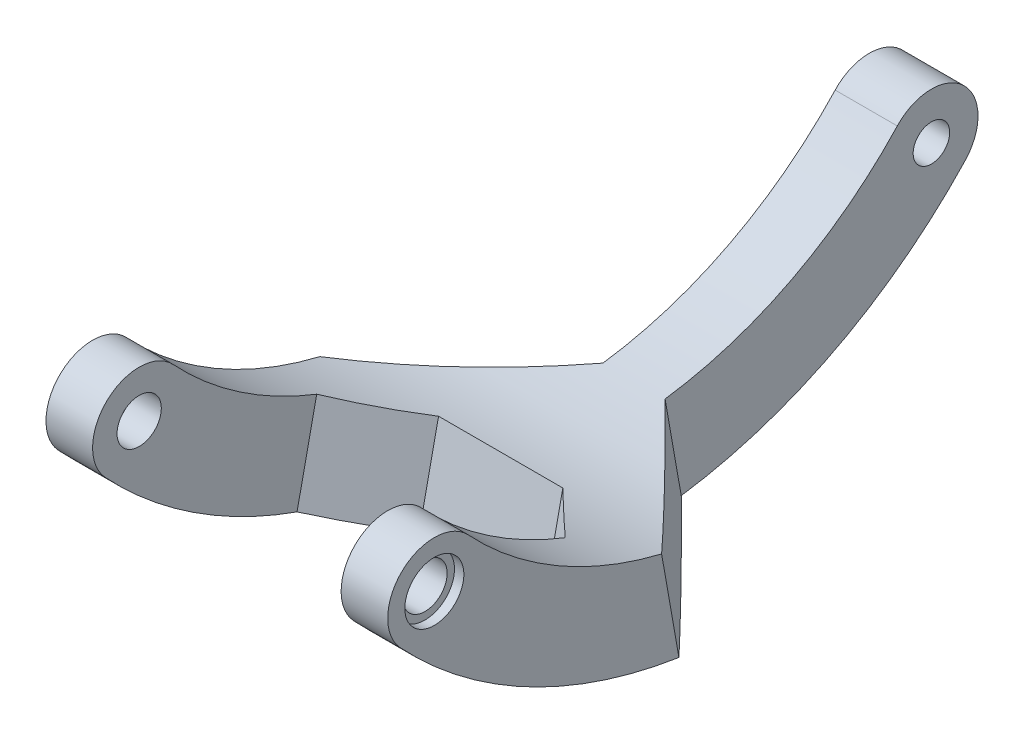
ISO-10303-21;
HEADER;
FILE_DESCRIPTION(('STEP AP214'),'2;1');
FILE_NAME('part.step','',(''),(''),'','','');
FILE_SCHEMA(('AUTOMOTIVE_DESIGN { 1 0 10303 214 1 1 1 1 }'));
ENDSEC;
DATA;
#1=APPLICATION_CONTEXT('core data for automotive mechanical design processes');
#2=APPLICATION_PROTOCOL_DEFINITION('international standard','automotive_design',2000,#1);
#3=PRODUCT_CONTEXT('',#1,'mechanical');
#4=PRODUCT('Part','Part','',(#3));
#5=PRODUCT_RELATED_PRODUCT_CATEGORY('part','',(#4));
#6=PRODUCT_DEFINITION_FORMATION('','',#4);
#7=PRODUCT_DEFINITION_CONTEXT('part definition',#1,'design');
#8=PRODUCT_DEFINITION('design','',#6,#7);
#9=PRODUCT_DEFINITION_SHAPE('','',#8);
#10=(LENGTH_UNIT() NAMED_UNIT(*) SI_UNIT(.MILLI.,.METRE.));
#11=(NAMED_UNIT(*) PLANE_ANGLE_UNIT() SI_UNIT($,.RADIAN.));
#12=(NAMED_UNIT(*) SI_UNIT($,.STERADIAN.) SOLID_ANGLE_UNIT());
#13=UNCERTAINTY_MEASURE_WITH_UNIT(LENGTH_MEASURE(1.E-05),#10,'distance_accuracy_value','');
#14=(GEOMETRIC_REPRESENTATION_CONTEXT(3) GLOBAL_UNCERTAINTY_ASSIGNED_CONTEXT((#13)) GLOBAL_UNIT_ASSIGNED_CONTEXT((#10,
#11,#12)) REPRESENTATION_CONTEXT('',''));
#15=CARTESIAN_POINT('',(0.,0.,0.));
#16=DIRECTION('',(0.,0.,1.));
#17=DIRECTION('',(1.,0.,0.));
#18=AXIS2_PLACEMENT_3D('',#15,#16,#17);
#19=CARTESIAN_POINT('',(11.,0.,20.5));
#20=DIRECTION('',(-1.,0.,0.));
#21=DIRECTION('',(0.,0.,1.));
#22=AXIS2_PLACEMENT_3D('',#19,#20,#21);
#23=CYLINDRICAL_SURFACE('',#22,1.425);
#24=CARTESIAN_POINT('',(-8.,0.,20.5));
#25=DIRECTION('',(1.,0.,0.));
#26=DIRECTION('',(0.,0.,-1.));
#27=AXIS2_PLACEMENT_3D('',#24,#25,#26);
#28=CIRCLE('',#27,1.425);
#29=CARTESIAN_POINT('',(-8.,0.,19.075));
#30=VERTEX_POINT('',#29);
#31=EDGE_CURVE('E267',#30,#30,#28,.F.);
#32=ORIENTED_EDGE('',*,*,#31,.F.);
#33=EDGE_LOOP('',(#32));
#34=FACE_BOUND('',#33,.T.);
#35=CARTESIAN_POINT('',(-10.,0.,20.5));
#36=DIRECTION('',(-1.,0.,0.));
#37=DIRECTION('',(0.,0.,1.));
#38=AXIS2_PLACEMENT_3D('',#35,#36,#37);
#39=CIRCLE('',#38,1.425);
#40=CARTESIAN_POINT('',(-10.,0.,21.925));
#41=VERTEX_POINT('',#40);
#42=EDGE_CURVE('E204',#41,#41,#39,.T.);
#43=ORIENTED_EDGE('',*,*,#42,.T.);
#44=EDGE_LOOP('',(#43));
#45=FACE_BOUND('',#44,.T.);
#46=ADVANCED_FACE('F49',(#34,#45),#23,.F.);
#47=CARTESIAN_POINT('',(11.,19.0722311227607,0.));
#48=DIRECTION('',(-1.,0.,0.));
#49=DIRECTION('',(0.,0.,1.));
#50=AXIS2_PLACEMENT_3D('',#47,#48,#49);
#51=CYLINDRICAL_SURFACE('',#50,25.);
#52=CARTESIAN_POINT('',(-2.,19.0722311227607,0.));
#53=DIRECTION('',(1.,0.,0.));
#54=DIRECTION('',(0.,0.,-1.));
#55=AXIS2_PLACEMENT_3D('',#52,#53,#54);
#56=CIRCLE('',#55,25.);
#57=CARTESIAN_POINT('',(-2.,2.04345333458149,-18.3035714285714));
#58=VERTEX_POINT('',#57);
#59=CARTESIAN_POINT('',(-2.,-5.70190684038016,-3.35292233480958));
#60=VERTEX_POINT('',#59);
#61=EDGE_CURVE('E156',#58,#60,#56,.F.);
#62=ORIENTED_EDGE('',*,*,#61,.T.);
#63=CARTESIAN_POINT('',(-0.999999999999926,19.0722311227607,0.));
#64=DIRECTION('',(-0.707106781186551,0.122787803968968,-0.696364240320016));
#65=DIRECTION('',(-0.707106781186544,-0.122787803968969,0.696364240320023));
#66=AXIS2_PLACEMENT_3D('',#63,#64,#65);
#67=ELLIPSE('',#66,35.3553390593272,25.);
#68=CARTESIAN_POINT('',(-11.,-5.22903101969766,5.86929793787319));
#69=VERTEX_POINT('',#68);
#70=EDGE_CURVE('E216',#60,#69,#67,.T.);
#71=ORIENTED_EDGE('',*,*,#70,.T.);
#72=CARTESIAN_POINT('',(-11.,19.0722311227607,0.));
#73=DIRECTION('',(1.,0.,0.));
#74=DIRECTION('',(0.,0.,-1.));
#75=AXIS2_PLACEMENT_3D('',#72,#73,#74);
#76=CIRCLE('',#75,25.);
#77=CARTESIAN_POINT('',(-11.,2.0434533345815,18.3035714285714));
#78=VERTEX_POINT('',#77);
#79=EDGE_CURVE('E278',#78,#69,#76,.T.);
#80=ORIENTED_EDGE('',*,*,#79,.F.);
#81=DIRECTION('',(-1.,0.,0.));
#82=VECTOR('',#81,1.);
#83=CARTESIAN_POINT('',(11.,2.0434533345815,18.3035714285714));
#84=LINE('',#83,#82);
#85=CARTESIAN_POINT('',(-8.,2.0434533345815,18.3035714285714));
#86=VERTEX_POINT('',#85);
#87=EDGE_CURVE('E185',#86,#78,#84,.T.);
#88=ORIENTED_EDGE('',*,*,#87,.F.);
#89=CARTESIAN_POINT('',(-8.,19.0722311227607,0.));
#90=DIRECTION('',(1.,0.,0.));
#91=DIRECTION('',(0.,0.,-1.));
#92=AXIS2_PLACEMENT_3D('',#89,#90,#91);
#93=CIRCLE('',#92,25.);
#94=CARTESIAN_POINT('',(-8.,-4.22428912871639,9.07039933919781));
#95=VERTEX_POINT('',#94);
#96=EDGE_CURVE('E244',#95,#86,#93,.F.);
#97=ORIENTED_EDGE('',*,*,#96,.F.);
#98=CARTESIAN_POINT('',(-3.99999999999997,19.0722311227607,0.));
#99=DIRECTION('',(0.707106781186544,0.147816494294591,0.691484116964709));
#100=DIRECTION('',(-0.707106781186551,0.147816494294589,0.691484116964701));
#101=AXIS2_PLACEMENT_3D('',#98,#99,#100);
#102=ELLIPSE('',#101,35.3553390593276,25.);
#103=CARTESIAN_POINT('',(-3.99999999999997,-5.37542428666607,5.22610227434636));
#104=VERTEX_POINT('',#103);
#105=EDGE_CURVE('E237',#95,#104,#102,.T.);
#106=ORIENTED_EDGE('',*,*,#105,.T.);
#107=DIRECTION('',(-1.,0.,0.));
#108=VECTOR('',#107,1.);
#109=CARTESIAN_POINT('',(34.168824834572,-5.37542428666607,5.22610227434636));
#110=LINE('',#109,#108);
#111=CARTESIAN_POINT('',(3.99999999999997,-5.37542428666607,5.22610227434636));
#112=VERTEX_POINT('',#111);
#113=EDGE_CURVE('E242',#112,#104,#110,.T.);
#114=ORIENTED_EDGE('',*,*,#113,.F.);
#115=CARTESIAN_POINT('',(3.99999999999997,19.0722311227607,0.));
#116=DIRECTION('',(0.707106781186544,-0.147816494294591,-0.691484116964708));
#117=DIRECTION('',(-0.707106781186551,-0.147816494294589,-0.691484116964701));
#118=AXIS2_PLACEMENT_3D('',#115,#116,#117);
#119=ELLIPSE('',#118,35.3553390593276,25.);
#120=CARTESIAN_POINT('',(8.,-4.22428912871639,9.07039933919781));
#121=VERTEX_POINT('',#120);
#122=EDGE_CURVE('E58',#112,#121,#119,.F.);
#123=ORIENTED_EDGE('',*,*,#122,.T.);
#124=CARTESIAN_POINT('',(8.,19.0722311227607,0.));
#125=DIRECTION('',(1.,0.,0.));
#126=DIRECTION('',(0.,0.,-1.));
#127=AXIS2_PLACEMENT_3D('',#124,#125,#126);
#128=CIRCLE('',#127,25.);
#129=CARTESIAN_POINT('',(8.,2.0434533345815,18.3035714285714));
#130=VERTEX_POINT('',#129);
#131=EDGE_CURVE('E254',#130,#121,#128,.T.);
#132=ORIENTED_EDGE('',*,*,#131,.F.);
#133=CARTESIAN_POINT('',(11.,2.0434533345815,18.3035714285714));
#134=VERTEX_POINT('',#133);
#135=EDGE_CURVE('E186',#134,#130,#84,.T.);
#136=ORIENTED_EDGE('',*,*,#135,.F.);
#137=CARTESIAN_POINT('',(11.,19.0722311227607,0.));
#138=DIRECTION('',(1.,0.,0.));
#139=DIRECTION('',(0.,0.,-1.));
#140=AXIS2_PLACEMENT_3D('',#137,#138,#139);
#141=CIRCLE('',#140,25.);
#142=CARTESIAN_POINT('',(11.,-5.22903101969769,5.86929793787307));
#143=VERTEX_POINT('',#142);
#144=EDGE_CURVE('E284',#134,#143,#141,.T.);
#145=ORIENTED_EDGE('',*,*,#144,.T.);
#146=CARTESIAN_POINT('',(0.999999999999822,19.0722311227607,0.));
#147=DIRECTION('',(0.707106781186544,0.122787803968969,-0.696364240320023));
#148=DIRECTION('',(-0.707106781186551,0.122787803968968,-0.696364240320016));
#149=AXIS2_PLACEMENT_3D('',#146,#147,#148);
#150=ELLIPSE('',#149,35.3553390593276,25.);
#151=CARTESIAN_POINT('',(2.,-5.70190684038017,-3.3529223348095));
#152=VERTEX_POINT('',#151);
#153=EDGE_CURVE('E213',#143,#152,#150,.T.);
#154=ORIENTED_EDGE('',*,*,#153,.T.);
#155=CARTESIAN_POINT('',(2.,19.0722311227607,0.));
#156=DIRECTION('',(1.,0.,0.));
#157=DIRECTION('',(0.,0.,-1.));
#158=AXIS2_PLACEMENT_3D('',#155,#156,#157);
#159=CIRCLE('',#158,25.);
#160=CARTESIAN_POINT('',(2.,2.04345333458149,-18.3035714285714));
#161=VERTEX_POINT('',#160);
#162=EDGE_CURVE('E361',#152,#161,#159,.T.);
#163=ORIENTED_EDGE('',*,*,#162,.T.);
#164=DIRECTION('',(-1.,0.,0.));
#165=VECTOR('',#164,1.);
#166=CARTESIAN_POINT('',(11.,2.04345333458149,-18.3035714285714));
#167=LINE('',#166,#165);
#168=EDGE_CURVE('E176',#161,#58,#167,.T.);
#169=ORIENTED_EDGE('',*,*,#168,.T.);
#170=EDGE_LOOP('',(#62,#71,#80,#88,#97,#106,#114,#123,#132,#136,#145,#154,#163,#169));
#171=FACE_BOUND('',#170,.T.);
#172=ADVANCED_FACE('F241',(#171),#51,.F.);
#173=CARTESIAN_POINT('',(11.,19.0722311227607,0.));
#174=DIRECTION('',(-1.,0.,0.));
#175=DIRECTION('',(0.,0.,1.));
#176=AXIS2_PLACEMENT_3D('',#173,#174,#175);
#177=CYLINDRICAL_SURFACE('',#176,31.);
#178=CARTESIAN_POINT('',(-0.999999999999926,19.0722311227607,0.));
#179=DIRECTION('',(-0.707106781186551,0.122787803968968,-0.696364240320016));
#180=DIRECTION('',(-0.707106781186544,-0.122787803968969,0.696364240320023));
#181=AXIS2_PLACEMENT_3D('',#178,#179,#180);
#182=ELLIPSE('',#181,43.8406204335657,31.);
#183=CARTESIAN_POINT('',(-11.,-11.5612690684152,4.75275352161561));
#184=VERTEX_POINT('',#183);
#185=CARTESIAN_POINT('',(-2.,-11.6145692679641,-4.39548424861381));
#186=VERTEX_POINT('',#185);
#187=EDGE_CURVE('E168',#184,#186,#182,.F.);
#188=ORIENTED_EDGE('',*,*,#187,.T.);
#189=CARTESIAN_POINT('',(-2.,19.0722311227607,0.));
#190=DIRECTION('',(1.,0.,0.));
#191=DIRECTION('',(0.,0.,-1.));
#192=AXIS2_PLACEMENT_3D('',#189,#190,#191);
#193=CIRCLE('',#192,31.);
#194=CARTESIAN_POINT('',(-2.,-2.0434533345815,-22.6964285714286));
#195=VERTEX_POINT('',#194);
#196=EDGE_CURVE('E154',#186,#195,#193,.T.);
#197=ORIENTED_EDGE('',*,*,#196,.T.);
#198=DIRECTION('',(-1.,0.,0.));
#199=VECTOR('',#198,1.);
#200=CARTESIAN_POINT('',(11.,-2.0434533345815,-22.6964285714286));
#201=LINE('',#200,#199);
#202=CARTESIAN_POINT('',(2.,-2.0434533345815,-22.6964285714286));
#203=VERTEX_POINT('',#202);
#204=EDGE_CURVE('E166',#203,#195,#201,.T.);
#205=ORIENTED_EDGE('',*,*,#204,.F.);
#206=CARTESIAN_POINT('',(2.,19.0722311227607,0.));
#207=DIRECTION('',(1.,0.,0.));
#208=DIRECTION('',(0.,0.,-1.));
#209=AXIS2_PLACEMENT_3D('',#206,#207,#208);
#210=CIRCLE('',#209,31.);
#211=CARTESIAN_POINT('',(2.,-11.6145692679642,-4.39548424861372));
#212=VERTEX_POINT('',#211);
#213=EDGE_CURVE('E365',#203,#212,#210,.F.);
#214=ORIENTED_EDGE('',*,*,#213,.T.);
#215=CARTESIAN_POINT('',(0.999999999999822,19.0722311227607,0.));
#216=DIRECTION('',(0.707106781186544,0.122787803968969,-0.696364240320023));
#217=DIRECTION('',(-0.707106781186551,0.122787803968968,-0.696364240320016));
#218=AXIS2_PLACEMENT_3D('',#215,#216,#217);
#219=ELLIPSE('',#218,43.8406204335662,31.);
#220=CARTESIAN_POINT('',(11.,-11.5612690684152,4.7527535216155));
#221=VERTEX_POINT('',#220);
#222=EDGE_CURVE('E210',#212,#221,#219,.F.);
#223=ORIENTED_EDGE('',*,*,#222,.T.);
#224=CARTESIAN_POINT('',(11.,19.0722311227607,0.));
#225=DIRECTION('',(1.,0.,0.));
#226=DIRECTION('',(0.,0.,-1.));
#227=AXIS2_PLACEMENT_3D('',#224,#225,#226);
#228=CIRCLE('',#227,31.);
#229=CARTESIAN_POINT('',(11.,-2.04345333458148,22.6964285714286));
#230=VERTEX_POINT('',#229);
#231=EDGE_CURVE('E180',#230,#221,#228,.T.);
#232=ORIENTED_EDGE('',*,*,#231,.F.);
#233=DIRECTION('',(-1.,0.,0.));
#234=VECTOR('',#233,1.);
#235=CARTESIAN_POINT('',(11.,-2.04345333458148,22.6964285714286));
#236=LINE('',#235,#234);
#237=CARTESIAN_POINT('',(8.,-2.04345333458148,22.6964285714286));
#238=VERTEX_POINT('',#237);
#239=EDGE_CURVE('E178',#230,#238,#236,.T.);
#240=ORIENTED_EDGE('',*,*,#239,.T.);
#241=CARTESIAN_POINT('',(8.,19.0722311227607,0.));
#242=DIRECTION('',(1.,0.,0.));
#243=DIRECTION('',(0.,0.,-1.));
#244=AXIS2_PLACEMENT_3D('',#241,#242,#243);
#245=CIRCLE('',#244,31.);
#246=CARTESIAN_POINT('',(8.,-10.1532630721689,10.3378183898799));
#247=VERTEX_POINT('',#246);
#248=EDGE_CURVE('E276',#238,#247,#245,.T.);
#249=ORIENTED_EDGE('',*,*,#248,.T.);
#250=CARTESIAN_POINT('',(3.99999999999997,19.0722311227607,0.));
#251=DIRECTION('',(0.707106781186544,-0.147816494294591,-0.691484116964708));
#252=DIRECTION('',(-0.707106781186551,-0.147816494294589,-0.691484116964701));
#253=AXIS2_PLACEMENT_3D('',#250,#251,#252);
#254=ELLIPSE('',#253,43.8406204335662,31.);
#255=CARTESIAN_POINT('',(3.99999999999997,-11.2428615849285,6.48036682018948));
#256=VERTEX_POINT('',#255);
#257=EDGE_CURVE('E13',#247,#256,#254,.T.);
#258=ORIENTED_EDGE('',*,*,#257,.T.);
#259=DIRECTION('',(-1.,0.,0.));
#260=VECTOR('',#259,1.);
#261=CARTESIAN_POINT('',(34.168824834572,-11.2428615849285,6.48036682018948));
#262=LINE('',#261,#260);
#263=CARTESIAN_POINT('',(-3.99999999999997,-11.2428615849285,6.48036682018948));
#264=VERTEX_POINT('',#263);
#265=EDGE_CURVE('E260',#256,#264,#262,.T.);
#266=ORIENTED_EDGE('',*,*,#265,.T.);
#267=CARTESIAN_POINT('',(-3.99999999999997,19.0722311227607,0.));
#268=DIRECTION('',(0.707106781186544,0.147816494294591,0.691484116964709));
#269=DIRECTION('',(-0.707106781186551,0.147816494294589,0.691484116964701));
#270=AXIS2_PLACEMENT_3D('',#267,#268,#269);
#271=ELLIPSE('',#270,43.8406204335662,31.);
#272=CARTESIAN_POINT('',(-8.,-10.1532630721689,10.3378183898799));
#273=VERTEX_POINT('',#272);
#274=EDGE_CURVE('E235',#264,#273,#271,.F.);
#275=ORIENTED_EDGE('',*,*,#274,.T.);
#276=CARTESIAN_POINT('',(-8.,19.0722311227607,0.));
#277=DIRECTION('',(1.,0.,0.));
#278=DIRECTION('',(0.,0.,-1.));
#279=AXIS2_PLACEMENT_3D('',#276,#277,#278);
#280=CIRCLE('',#279,31.);
#281=CARTESIAN_POINT('',(-8.,-2.04345333458148,22.6964285714286));
#282=VERTEX_POINT('',#281);
#283=EDGE_CURVE('E258',#273,#282,#280,.F.);
#284=ORIENTED_EDGE('',*,*,#283,.T.);
#285=CARTESIAN_POINT('',(-11.,-2.04345333458148,22.6964285714286));
#286=VERTEX_POINT('',#285);
#287=EDGE_CURVE('E175',#282,#286,#236,.T.);
#288=ORIENTED_EDGE('',*,*,#287,.T.);
#289=CARTESIAN_POINT('',(-11.,19.0722311227607,0.));
#290=DIRECTION('',(1.,0.,0.));
#291=DIRECTION('',(0.,0.,-1.));
#292=AXIS2_PLACEMENT_3D('',#289,#290,#291);
#293=CIRCLE('',#292,31.);
#294=EDGE_CURVE('E288',#286,#184,#293,.T.);
#295=ORIENTED_EDGE('',*,*,#294,.T.);
#296=EDGE_LOOP('',(#188,#197,#205,#214,#223,#232,#240,#249,#258,#266,#275,#284,#288,#295));
#297=FACE_BOUND('',#296,.T.);
#298=ADVANCED_FACE('F165',(#297),#177,.T.);
#299=CARTESIAN_POINT('',(-11.,0.,0.));
#300=DIRECTION('',(1.,0.,0.));
#301=DIRECTION('',(0.,0.,-1.));
#302=AXIS2_PLACEMENT_3D('',#299,#300,#301);
#303=PLANE('',#302);
#304=CARTESIAN_POINT('',(-11.,0.,20.5));
#305=DIRECTION('',(1.,0.,0.));
#306=DIRECTION('',(0.,0.,-1.));
#307=AXIS2_PLACEMENT_3D('',#304,#305,#306);
#308=CIRCLE('',#307,1.9);
#309=CARTESIAN_POINT('',(-11.,0.,18.6));
#310=VERTEX_POINT('',#309);
#311=EDGE_CURVE('E161',#310,#310,#308,.T.);
#312=ORIENTED_EDGE('',*,*,#311,.T.);
#313=EDGE_LOOP('',(#312));
#314=FACE_BOUND('',#313,.T.);
#315=ORIENTED_EDGE('',*,*,#79,.T.);
#316=DIRECTION('',(0.,-0.984807753012209,-0.173648177666924));
#317=VECTOR('',#316,1.);
#318=CARTESIAN_POINT('',(-11.,-13.1932909972871,4.46498402244763));
#319=LINE('',#318,#317);
#320=EDGE_CURVE('E189',#69,#184,#319,.T.);
#321=ORIENTED_EDGE('',*,*,#320,.T.);
#322=ORIENTED_EDGE('',*,*,#294,.F.);
#323=CARTESIAN_POINT('',(-11.,0.,20.5));
#324=DIRECTION('',(1.,0.,0.));
#325=DIRECTION('',(0.,0.,-1.));
#326=AXIS2_PLACEMENT_3D('',#323,#324,#325);
#327=CIRCLE('',#326,3.);
#328=EDGE_CURVE('E295',#78,#286,#327,.T.);
#329=ORIENTED_EDGE('',*,*,#328,.F.);
#330=EDGE_LOOP('',(#315,#321,#322,#329));
#331=FACE_BOUND('',#330,.T.);
#332=ADVANCED_FACE('F300',(#314,#331),#303,.F.);
#333=CARTESIAN_POINT('',(8.,0.,20.5));
#334=DIRECTION('',(1.,0.,0.));
#335=DIRECTION('',(0.,0.,-1.));
#336=AXIS2_PLACEMENT_3D('',#333,#334,#335);
#337=CIRCLE('',#336,1.425);
#338=CARTESIAN_POINT('',(8.,0.,19.075));
#339=VERTEX_POINT('',#338);
#340=EDGE_CURVE('E253',#339,#339,#337,.T.);
#341=ORIENTED_EDGE('',*,*,#340,.F.);
#342=EDGE_LOOP('',(#341));
#343=FACE_BOUND('',#342,.T.);
#344=CARTESIAN_POINT('',(10.4,0.,20.5));
#345=DIRECTION('',(1.,0.,0.));
#346=DIRECTION('',(0.,0.,-1.));
#347=AXIS2_PLACEMENT_3D('',#344,#345,#346);
#348=CIRCLE('',#347,1.425);
#349=CARTESIAN_POINT('',(10.4,0.,19.075));
#350=VERTEX_POINT('',#349);
#351=EDGE_CURVE('E193',#350,#350,#348,.T.);
#352=ORIENTED_EDGE('',*,*,#351,.T.);
#353=EDGE_LOOP('',(#352));
#354=FACE_BOUND('',#353,.T.);
#355=ADVANCED_FACE('F325',(#343,#354),#23,.F.);
#356=CARTESIAN_POINT('',(11.,0.,-20.5));
#357=DIRECTION('',(-1.,0.,0.));
#358=DIRECTION('',(0.,0.,1.));
#359=AXIS2_PLACEMENT_3D('',#356,#357,#358);
#360=CYLINDRICAL_SURFACE('',#359,3.);
#361=ORIENTED_EDGE('',*,*,#204,.T.);
#362=CARTESIAN_POINT('',(-2.,0.,-20.5));
#363=DIRECTION('',(1.,0.,0.));
#364=DIRECTION('',(0.,0.,-1.));
#365=AXIS2_PLACEMENT_3D('',#362,#363,#364);
#366=CIRCLE('',#365,3.);
#367=EDGE_CURVE('E149',#195,#58,#366,.T.);
#368=ORIENTED_EDGE('',*,*,#367,.T.);
#369=ORIENTED_EDGE('',*,*,#168,.F.);
#370=CARTESIAN_POINT('',(2.,0.,-20.5));
#371=DIRECTION('',(1.,0.,0.));
#372=DIRECTION('',(0.,0.,-1.));
#373=AXIS2_PLACEMENT_3D('',#370,#371,#372);
#374=CIRCLE('',#373,3.);
#375=EDGE_CURVE('E174',#161,#203,#374,.F.);
#376=ORIENTED_EDGE('',*,*,#375,.T.);
#377=EDGE_LOOP('',(#361,#368,#369,#376));
#378=FACE_BOUND('',#377,.T.);
#379=ADVANCED_FACE('F173',(#378),#360,.T.);
#380=CARTESIAN_POINT('',(11.,0.,-20.5));
#381=DIRECTION('',(-1.,0.,0.));
#382=DIRECTION('',(0.,0.,1.));
#383=AXIS2_PLACEMENT_3D('',#380,#381,#382);
#384=CYLINDRICAL_SURFACE('',#383,1.175);
#385=CARTESIAN_POINT('',(-2.,0.,-20.5));
#386=DIRECTION('',(1.,0.,0.));
#387=DIRECTION('',(0.,0.,-1.));
#388=AXIS2_PLACEMENT_3D('',#385,#386,#387);
#389=CIRCLE('',#388,1.175);
#390=CARTESIAN_POINT('',(-2.,0.,-21.675));
#391=VERTEX_POINT('',#390);
#392=EDGE_CURVE('E170',#391,#391,#389,.F.);
#393=ORIENTED_EDGE('',*,*,#392,.T.);
#394=EDGE_LOOP('',(#393));
#395=FACE_BOUND('',#394,.T.);
#396=CARTESIAN_POINT('',(2.,0.,-20.5));
#397=DIRECTION('',(1.,0.,0.));
#398=DIRECTION('',(0.,0.,-1.));
#399=AXIS2_PLACEMENT_3D('',#396,#397,#398);
#400=CIRCLE('',#399,1.175);
#401=CARTESIAN_POINT('',(2.,0.,-21.675));
#402=VERTEX_POINT('',#401);
#403=EDGE_CURVE('E197',#402,#402,#400,.T.);
#404=ORIENTED_EDGE('',*,*,#403,.T.);
#405=EDGE_LOOP('',(#404));
#406=FACE_BOUND('',#405,.T.);
#407=ADVANCED_FACE('F338',(#395,#406),#384,.F.);
#408=CARTESIAN_POINT('',(11.,0.,20.5));
#409=DIRECTION('',(-1.,0.,0.));
#410=DIRECTION('',(0.,0.,1.));
#411=AXIS2_PLACEMENT_3D('',#408,#409,#410);
#412=CYLINDRICAL_SURFACE('',#411,3.);
#413=CARTESIAN_POINT('',(-8.,0.,20.5));
#414=DIRECTION('',(1.,0.,0.));
#415=DIRECTION('',(0.,0.,-1.));
#416=AXIS2_PLACEMENT_3D('',#413,#414,#415);
#417=CIRCLE('',#416,3.);
#418=EDGE_CURVE('E265',#282,#86,#417,.F.);
#419=ORIENTED_EDGE('',*,*,#418,.T.);
#420=ORIENTED_EDGE('',*,*,#87,.T.);
#421=ORIENTED_EDGE('',*,*,#328,.T.);
#422=ORIENTED_EDGE('',*,*,#287,.F.);
#423=EDGE_LOOP('',(#419,#420,#421,#422));
#424=FACE_BOUND('',#423,.T.);
#425=ADVANCED_FACE('F304',(#424),#412,.T.);
#426=ORIENTED_EDGE('',*,*,#135,.T.);
#427=CARTESIAN_POINT('',(8.,0.,20.5));
#428=DIRECTION('',(1.,0.,0.));
#429=DIRECTION('',(0.,0.,-1.));
#430=AXIS2_PLACEMENT_3D('',#427,#428,#429);
#431=CIRCLE('',#430,3.);
#432=EDGE_CURVE('E279',#130,#238,#431,.T.);
#433=ORIENTED_EDGE('',*,*,#432,.T.);
#434=ORIENTED_EDGE('',*,*,#239,.F.);
#435=CARTESIAN_POINT('',(11.,0.,20.5));
#436=DIRECTION('',(1.,0.,0.));
#437=DIRECTION('',(0.,0.,-1.));
#438=AXIS2_PLACEMENT_3D('',#435,#436,#437);
#439=CIRCLE('',#438,3.);
#440=EDGE_CURVE('E287',#134,#230,#439,.T.);
#441=ORIENTED_EDGE('',*,*,#440,.F.);
#442=EDGE_LOOP('',(#426,#433,#434,#441));
#443=FACE_BOUND('',#442,.T.);
#444=ADVANCED_FACE('F377',(#443),#412,.T.);
#445=CARTESIAN_POINT('',(11.,0.,0.));
#446=DIRECTION('',(1.,0.,0.));
#447=DIRECTION('',(0.,0.,-1.));
#448=AXIS2_PLACEMENT_3D('',#445,#446,#447);
#449=PLANE('',#448);
#450=CARTESIAN_POINT('',(11.,0.,20.5));
#451=DIRECTION('',(1.,0.,0.));
#452=DIRECTION('',(0.,0.,-1.));
#453=AXIS2_PLACEMENT_3D('',#450,#451,#452);
#454=CIRCLE('',#453,1.9);
#455=CARTESIAN_POINT('',(11.,0.,22.4));
#456=VERTEX_POINT('',#455);
#457=EDGE_CURVE('E190',#456,#456,#454,.F.);
#458=ORIENTED_EDGE('',*,*,#457,.T.);
#459=EDGE_LOOP('',(#458));
#460=FACE_BOUND('',#459,.T.);
#461=ORIENTED_EDGE('',*,*,#231,.T.);
#462=DIRECTION('',(0.,0.984807753012209,0.173648177666924));
#463=VECTOR('',#462,1.);
#464=CARTESIAN_POINT('',(11.,-7.28444447921383,5.50687308844907));
#465=LINE('',#464,#463);
#466=EDGE_CURVE('E218',#221,#143,#465,.T.);
#467=ORIENTED_EDGE('',*,*,#466,.T.);
#468=ORIENTED_EDGE('',*,*,#144,.F.);
#469=ORIENTED_EDGE('',*,*,#440,.T.);
#470=EDGE_LOOP('',(#461,#467,#468,#469));
#471=FACE_BOUND('',#470,.T.);
#472=ADVANCED_FACE('F373',(#460,#471),#449,.T.);
#473=CARTESIAN_POINT('',(34.168824834572,0.83344566648589,3.89885068969024));
#474=DIRECTION('',(0.,0.209044090973854,0.977906216377069));
#475=DIRECTION('',(0.,-0.977906216377069,0.209044090973854));
#476=AXIS2_PLACEMENT_3D('',#473,#474,#475);
#477=PLANE('',#476);
#478=ORIENTED_EDGE('',*,*,#113,.T.);
#479=DIRECTION('',(0.,-0.977906216377069,0.209044090973854));
#480=VECTOR('',#479,1.);
#481=CARTESIAN_POINT('',(-3.99999999999997,-11.2428615849285,6.48036682018948));
#482=LINE('',#481,#480);
#483=EDGE_CURVE('E229',#104,#264,#482,.T.);
#484=ORIENTED_EDGE('',*,*,#483,.T.);
#485=ORIENTED_EDGE('',*,*,#265,.F.);
#486=DIRECTION('',(0.,0.977906216377069,-0.209044090973854));
#487=VECTOR('',#486,1.);
#488=CARTESIAN_POINT('',(3.99999999999997,0.83344566648589,3.89885068969024));
#489=LINE('',#488,#487);
#490=EDGE_CURVE('E226',#256,#112,#489,.T.);
#491=ORIENTED_EDGE('',*,*,#490,.T.);
#492=EDGE_LOOP('',(#478,#484,#485,#491));
#493=FACE_BOUND('',#492,.T.);
#494=ADVANCED_FACE('F249',(#493),#477,.T.);
#495=CARTESIAN_POINT('',(8.,0.,0.));
#496=DIRECTION('',(1.,0.,0.));
#497=DIRECTION('',(0.,0.,-1.));
#498=AXIS2_PLACEMENT_3D('',#495,#496,#497);
#499=PLANE('',#498);
#500=ORIENTED_EDGE('',*,*,#340,.T.);
#501=EDGE_LOOP('',(#500));
#502=FACE_BOUND('',#501,.T.);
#503=ORIENTED_EDGE('',*,*,#131,.T.);
#504=DIRECTION('',(0.,-0.977906216377069,0.209044090973854));
#505=VECTOR('',#504,1.);
#506=CARTESIAN_POINT('',(8.,1.66962203038131,7.81047555519851));
#507=LINE('',#506,#505);
#508=EDGE_CURVE('E65',#121,#247,#507,.T.);
#509=ORIENTED_EDGE('',*,*,#508,.T.);
#510=ORIENTED_EDGE('',*,*,#248,.F.);
#511=ORIENTED_EDGE('',*,*,#432,.F.);
#512=EDGE_LOOP('',(#503,#509,#510,#511));
#513=FACE_BOUND('',#512,.T.);
#514=ADVANCED_FACE('F430',(#502,#513),#499,.F.);
#515=CARTESIAN_POINT('',(-8.,0.,0.));
#516=DIRECTION('',(1.,0.,0.));
#517=DIRECTION('',(0.,0.,-1.));
#518=AXIS2_PLACEMENT_3D('',#515,#516,#517);
#519=PLANE('',#518);
#520=ORIENTED_EDGE('',*,*,#283,.F.);
#521=DIRECTION('',(0.,0.977906216377069,-0.209044090973854));
#522=VECTOR('',#521,1.);
#523=CARTESIAN_POINT('',(-8.,-4.53924792277066,9.13772713985462));
#524=LINE('',#523,#522);
#525=EDGE_CURVE('E232',#273,#95,#524,.T.);
#526=ORIENTED_EDGE('',*,*,#525,.T.);
#527=ORIENTED_EDGE('',*,*,#96,.T.);
#528=ORIENTED_EDGE('',*,*,#418,.F.);
#529=EDGE_LOOP('',(#520,#526,#527,#528));
#530=FACE_BOUND('',#529,.T.);
#531=ORIENTED_EDGE('',*,*,#31,.T.);
#532=EDGE_LOOP('',(#531));
#533=FACE_BOUND('',#532,.T.);
#534=ADVANCED_FACE('F262',(#530,#533),#519,.T.);
#535=CARTESIAN_POINT('',(2.,0.,0.));
#536=DIRECTION('',(1.,0.,0.));
#537=DIRECTION('',(0.,0.,-1.));
#538=AXIS2_PLACEMENT_3D('',#535,#536,#537);
#539=PLANE('',#538);
#540=ORIENTED_EDGE('',*,*,#403,.F.);
#541=EDGE_LOOP('',(#540));
#542=FACE_BOUND('',#541,.T.);
#543=ORIENTED_EDGE('',*,*,#162,.F.);
#544=DIRECTION('',(0.,-0.984807753012209,-0.173648177666924));
#545=VECTOR('',#544,1.);
#546=CARTESIAN_POINT('',(2.,0.401449959722567,-2.27673585806095));
#547=LINE('',#546,#545);
#548=EDGE_CURVE('E223',#152,#212,#547,.T.);
#549=ORIENTED_EDGE('',*,*,#548,.T.);
#550=ORIENTED_EDGE('',*,*,#213,.F.);
#551=ORIENTED_EDGE('',*,*,#375,.F.);
#552=EDGE_LOOP('',(#543,#549,#550,#551));
#553=FACE_BOUND('',#552,.T.);
#554=ADVANCED_FACE('F369',(#542,#553),#539,.T.);
#555=CARTESIAN_POINT('',(11.000012,0.,20.5));
#556=DIRECTION('',(-1.,0.,0.));
#557=DIRECTION('',(0.,0.,1.));
#558=AXIS2_PLACEMENT_3D('',#555,#556,#557);
#559=CYLINDRICAL_SURFACE('',#558,1.9);
#560=CARTESIAN_POINT('',(10.4,0.,20.5));
#561=DIRECTION('',(1.,0.,0.));
#562=DIRECTION('',(0.,0.,-1.));
#563=AXIS2_PLACEMENT_3D('',#560,#561,#562);
#564=CIRCLE('',#563,1.9);
#565=CARTESIAN_POINT('',(10.4,0.,22.4));
#566=VERTEX_POINT('',#565);
#567=EDGE_CURVE('E194',#566,#566,#564,.T.);
#568=CARTESIAN_POINT('',(11.,0.,22.4));
#569=CARTESIAN_POINT('',(10.99375,0.,22.4));
#570=CARTESIAN_POINT('',(10.9875,0.,22.4));
#571=CARTESIAN_POINT('',(10.975,0.,22.4));
#572=CARTESIAN_POINT('',(10.96875,0.,22.4));
#573=CARTESIAN_POINT('',(10.95625,0.,22.4));
#574=CARTESIAN_POINT('',(10.95,0.,22.4));
#575=CARTESIAN_POINT('',(10.9375,0.,22.4));
#576=CARTESIAN_POINT('',(10.93125,0.,22.4));
#577=CARTESIAN_POINT('',(10.91875,0.,22.4));
#578=CARTESIAN_POINT('',(10.9125,0.,22.4));
#579=CARTESIAN_POINT('',(10.9,0.,22.4));
#580=CARTESIAN_POINT('',(10.89375,0.,22.4));
#581=CARTESIAN_POINT('',(10.88125,0.,22.4));
#582=CARTESIAN_POINT('',(10.875,0.,22.4));
#583=CARTESIAN_POINT('',(10.8625,0.,22.4));
#584=CARTESIAN_POINT('',(10.85625,0.,22.4));
#585=CARTESIAN_POINT('',(10.84375,0.,22.4));
#586=CARTESIAN_POINT('',(10.8375,0.,22.4));
#587=CARTESIAN_POINT('',(10.825,0.,22.4));
#588=CARTESIAN_POINT('',(10.81875,0.,22.4));
#589=CARTESIAN_POINT('',(10.80625,0.,22.4));
#590=CARTESIAN_POINT('',(10.8,0.,22.4));
#591=CARTESIAN_POINT('',(10.7875,0.,22.4));
#592=CARTESIAN_POINT('',(10.78125,0.,22.4));
#593=CARTESIAN_POINT('',(10.76875,0.,22.4));
#594=CARTESIAN_POINT('',(10.7625,0.,22.4));
#595=CARTESIAN_POINT('',(10.75,0.,22.4));
#596=CARTESIAN_POINT('',(10.74375,0.,22.4));
#597=CARTESIAN_POINT('',(10.73125,0.,22.4));
#598=CARTESIAN_POINT('',(10.725,0.,22.4));
#599=CARTESIAN_POINT('',(10.7125,0.,22.4));
#600=CARTESIAN_POINT('',(10.70625,0.,22.4));
#601=CARTESIAN_POINT('',(10.69375,0.,22.4));
#602=CARTESIAN_POINT('',(10.6875,0.,22.4));
#603=CARTESIAN_POINT('',(10.675,0.,22.4));
#604=CARTESIAN_POINT('',(10.66875,0.,22.4));
#605=CARTESIAN_POINT('',(10.65625,0.,22.4));
#606=CARTESIAN_POINT('',(10.65,0.,22.4));
#607=CARTESIAN_POINT('',(10.6375,0.,22.4));
#608=CARTESIAN_POINT('',(10.63125,0.,22.4));
#609=CARTESIAN_POINT('',(10.61875,0.,22.4));
#610=CARTESIAN_POINT('',(10.6125,0.,22.4));
#611=CARTESIAN_POINT('',(10.6,0.,22.4));
#612=CARTESIAN_POINT('',(10.59375,0.,22.4));
#613=CARTESIAN_POINT('',(10.58125,0.,22.4));
#614=CARTESIAN_POINT('',(10.575,0.,22.4));
#615=CARTESIAN_POINT('',(10.5625,0.,22.4));
#616=CARTESIAN_POINT('',(10.55625,0.,22.4));
#617=CARTESIAN_POINT('',(10.54375,0.,22.4));
#618=CARTESIAN_POINT('',(10.5375,0.,22.4));
#619=CARTESIAN_POINT('',(10.525,0.,22.4));
#620=CARTESIAN_POINT('',(10.51875,0.,22.4));
#621=CARTESIAN_POINT('',(10.50625,0.,22.4));
#622=CARTESIAN_POINT('',(10.5,0.,22.4));
#623=CARTESIAN_POINT('',(10.4875,0.,22.4));
#624=CARTESIAN_POINT('',(10.48125,0.,22.4));
#625=CARTESIAN_POINT('',(10.46875,0.,22.4));
#626=CARTESIAN_POINT('',(10.4625,0.,22.4));
#627=CARTESIAN_POINT('',(10.45,0.,22.4));
#628=CARTESIAN_POINT('',(10.44375,0.,22.4));
#629=CARTESIAN_POINT('',(10.43125,0.,22.4));
#630=CARTESIAN_POINT('',(10.425,0.,22.4));
#631=CARTESIAN_POINT('',(10.4125,0.,22.4));
#632=CARTESIAN_POINT('',(10.40625,0.,22.4));
#633=CARTESIAN_POINT('',(10.4,0.,22.4));
#634=B_SPLINE_CURVE_WITH_KNOTS('',3,(#568,#569,#570,#571,#572,#573,#574,#575,#576,#577,#578,
#579,#580,#581,#582,#583,#584,#585,#586,#587,#588,#589,#590,#591,#592,#593,#594,#595,#596,#597,
#598,#599,#600,#601,#602,#603,#604,#605,#606,#607,#608,#609,#610,#611,#612,#613,#614,#615,#616,
#617,#618,#619,#620,#621,#622,#623,#624,#625,#626,#627,#628,#629,#630,#631,#632,#633),
.UNSPECIFIED.,.F.,.F.,(4,2,2,2,2,2,2,2,2,2,2,2,2,2,2,2,2,2,2,2,2,2,2,2,2,2,2,2,2,2,2,2,4),(0.,
0.0187499999999997,0.0374999999999993,0.056249999999999,0.0749999999999987,0.0937499999999983,
0.1125,0.131249999999999,0.149999999999999,0.168749999999999,0.187499999999998,0.20625,0.225,
0.243749999999999,0.262499999999999,0.281249999999999,0.3,0.31875,0.337499999999999,
0.356249999999999,0.374999999999999,0.39375,0.4125,0.431249999999999,0.449999999999999,
0.468749999999999,0.487499999999998,0.50625,0.524999999999999,0.543749999999999,
0.562499999999999,0.581249999999998,0.6),.UNSPECIFIED.);
#635=EDGE_CURVE('BSEAM349',#456,#566,#634,.T.);
#636=ORIENTED_EDGE('',*,*,#457,.F.);
#637=ORIENTED_EDGE('',*,*,#567,.F.);
#638=ORIENTED_EDGE('',*,*,#635,.T.);
#639=ORIENTED_EDGE('',*,*,#635,.F.);
#640=EDGE_LOOP('',(#636,#638,#637,#639));
#641=FACE_BOUND('',#640,.T.);
#642=ADVANCED_FACE('F349',(#641),#559,.F.);
#643=CARTESIAN_POINT('',(10.4,0.,20.5));
#644=DIRECTION('',(1.,0.,0.));
#645=DIRECTION('',(0.,0.,-1.));
#646=AXIS2_PLACEMENT_3D('',#643,#644,#645);
#647=PLANE('',#646);
#648=ORIENTED_EDGE('',*,*,#351,.F.);
#649=EDGE_LOOP('',(#648));
#650=FACE_BOUND('',#649,.T.);
#651=ORIENTED_EDGE('',*,*,#567,.T.);
#652=EDGE_LOOP('',(#651));
#653=FACE_BOUND('',#652,.T.);
#654=ADVANCED_FACE('F346',(#650,#653),#647,.T.);
#655=CARTESIAN_POINT('',(-2.,0.,0.));
#656=DIRECTION('',(1.,0.,0.));
#657=DIRECTION('',(0.,0.,-1.));
#658=AXIS2_PLACEMENT_3D('',#655,#656,#657);
#659=PLANE('',#658);
#660=ORIENTED_EDGE('',*,*,#367,.F.);
#661=ORIENTED_EDGE('',*,*,#196,.F.);
#662=DIRECTION('',(0.,0.984807753012209,0.173648177666924));
#663=VECTOR('',#662,1.);
#664=CARTESIAN_POINT('',(-2.,0.401449959722581,-2.27673585806103));
#665=LINE('',#664,#663);
#666=EDGE_CURVE('E221',#186,#60,#665,.T.);
#667=ORIENTED_EDGE('',*,*,#666,.T.);
#668=ORIENTED_EDGE('',*,*,#61,.F.);
#669=EDGE_LOOP('',(#660,#661,#667,#668));
#670=FACE_BOUND('',#669,.T.);
#671=ORIENTED_EDGE('',*,*,#392,.F.);
#672=EDGE_LOOP('',(#671));
#673=FACE_BOUND('',#672,.T.);
#674=ADVANCED_FACE('F151',(#670,#673),#659,.F.);
#675=CARTESIAN_POINT('',(-11.000012,0.,20.5));
#676=DIRECTION('',(1.,0.,0.));
#677=DIRECTION('',(0.,0.,-1.));
#678=AXIS2_PLACEMENT_3D('',#675,#676,#677);
#679=CYLINDRICAL_SURFACE('',#678,1.9);
#680=CARTESIAN_POINT('',(-10.4,0.,20.5));
#681=DIRECTION('',(1.,0.,0.));
#682=DIRECTION('',(0.,0.,-1.));
#683=AXIS2_PLACEMENT_3D('',#680,#681,#682);
#684=CIRCLE('',#683,1.9);
#685=CARTESIAN_POINT('',(-10.4,0.,18.6));
#686=VERTEX_POINT('',#685);
#687=EDGE_CURVE('E200',#686,#686,#684,.T.);
#688=CARTESIAN_POINT('',(-10.4,0.,18.6));
#689=CARTESIAN_POINT('',(-10.40625,0.,18.6));
#690=CARTESIAN_POINT('',(-10.4125,0.,18.6));
#691=CARTESIAN_POINT('',(-10.425,0.,18.6));
#692=CARTESIAN_POINT('',(-10.43125,0.,18.6));
#693=CARTESIAN_POINT('',(-10.44375,0.,18.6));
#694=CARTESIAN_POINT('',(-10.45,0.,18.6));
#695=CARTESIAN_POINT('',(-10.4625,0.,18.6));
#696=CARTESIAN_POINT('',(-10.46875,0.,18.6));
#697=CARTESIAN_POINT('',(-10.48125,0.,18.6));
#698=CARTESIAN_POINT('',(-10.4875,0.,18.6));
#699=CARTESIAN_POINT('',(-10.5,0.,18.6));
#700=CARTESIAN_POINT('',(-10.50625,0.,18.6));
#701=CARTESIAN_POINT('',(-10.51875,0.,18.6));
#702=CARTESIAN_POINT('',(-10.525,0.,18.6));
#703=CARTESIAN_POINT('',(-10.5375,0.,18.6));
#704=CARTESIAN_POINT('',(-10.54375,0.,18.6));
#705=CARTESIAN_POINT('',(-10.55625,0.,18.6));
#706=CARTESIAN_POINT('',(-10.5625,0.,18.6));
#707=CARTESIAN_POINT('',(-10.575,0.,18.6));
#708=CARTESIAN_POINT('',(-10.58125,0.,18.6));
#709=CARTESIAN_POINT('',(-10.59375,0.,18.6));
#710=CARTESIAN_POINT('',(-10.6,0.,18.6));
#711=CARTESIAN_POINT('',(-10.6125,0.,18.6));
#712=CARTESIAN_POINT('',(-10.61875,0.,18.6));
#713=CARTESIAN_POINT('',(-10.63125,0.,18.6));
#714=CARTESIAN_POINT('',(-10.6375,0.,18.6));
#715=CARTESIAN_POINT('',(-10.65,0.,18.6));
#716=CARTESIAN_POINT('',(-10.65625,0.,18.6));
#717=CARTESIAN_POINT('',(-10.66875,0.,18.6));
#718=CARTESIAN_POINT('',(-10.675,0.,18.6));
#719=CARTESIAN_POINT('',(-10.6875,0.,18.6));
#720=CARTESIAN_POINT('',(-10.69375,0.,18.6));
#721=CARTESIAN_POINT('',(-10.70625,0.,18.6));
#722=CARTESIAN_POINT('',(-10.7125,0.,18.6));
#723=CARTESIAN_POINT('',(-10.725,0.,18.6));
#724=CARTESIAN_POINT('',(-10.73125,0.,18.6));
#725=CARTESIAN_POINT('',(-10.74375,0.,18.6));
#726=CARTESIAN_POINT('',(-10.75,0.,18.6));
#727=CARTESIAN_POINT('',(-10.7625,0.,18.6));
#728=CARTESIAN_POINT('',(-10.76875,0.,18.6));
#729=CARTESIAN_POINT('',(-10.78125,0.,18.6));
#730=CARTESIAN_POINT('',(-10.7875,0.,18.6));
#731=CARTESIAN_POINT('',(-10.8,0.,18.6));
#732=CARTESIAN_POINT('',(-10.80625,0.,18.6));
#733=CARTESIAN_POINT('',(-10.81875,0.,18.6));
#734=CARTESIAN_POINT('',(-10.825,0.,18.6));
#735=CARTESIAN_POINT('',(-10.8375,0.,18.6));
#736=CARTESIAN_POINT('',(-10.84375,0.,18.6));
#737=CARTESIAN_POINT('',(-10.85625,0.,18.6));
#738=CARTESIAN_POINT('',(-10.8625,0.,18.6));
#739=CARTESIAN_POINT('',(-10.875,0.,18.6));
#740=CARTESIAN_POINT('',(-10.88125,0.,18.6));
#741=CARTESIAN_POINT('',(-10.89375,0.,18.6));
#742=CARTESIAN_POINT('',(-10.9,0.,18.6));
#743=CARTESIAN_POINT('',(-10.9125,0.,18.6));
#744=CARTESIAN_POINT('',(-10.91875,0.,18.6));
#745=CARTESIAN_POINT('',(-10.93125,0.,18.6));
#746=CARTESIAN_POINT('',(-10.9375,0.,18.6));
#747=CARTESIAN_POINT('',(-10.95,0.,18.6));
#748=CARTESIAN_POINT('',(-10.95625,0.,18.6));
#749=CARTESIAN_POINT('',(-10.96875,0.,18.6));
#750=CARTESIAN_POINT('',(-10.975,0.,18.6));
#751=CARTESIAN_POINT('',(-10.9875,0.,18.6));
#752=CARTESIAN_POINT('',(-10.99375,0.,18.6));
#753=CARTESIAN_POINT('',(-11.,0.,18.6));
#754=B_SPLINE_CURVE_WITH_KNOTS('',3,(#688,#689,#690,#691,#692,#693,#694,#695,#696,#697,#698,
#699,#700,#701,#702,#703,#704,#705,#706,#707,#708,#709,#710,#711,#712,#713,#714,#715,#716,#717,
#718,#719,#720,#721,#722,#723,#724,#725,#726,#727,#728,#729,#730,#731,#732,#733,#734,#735,#736,
#737,#738,#739,#740,#741,#742,#743,#744,#745,#746,#747,#748,#749,#750,#751,#752,#753),
.UNSPECIFIED.,.F.,.F.,(4,2,2,2,2,2,2,2,2,2,2,2,2,2,2,2,2,2,2,2,2,2,2,2,2,2,2,2,2,2,2,2,4),(0.,
0.0187499999999997,0.0374999999999993,0.056249999999999,0.0749999999999987,0.0937499999999983,
0.1125,0.131249999999999,0.149999999999999,0.168749999999999,0.187499999999998,0.20625,0.225,
0.243749999999999,0.262499999999999,0.281249999999999,0.3,0.31875,0.337499999999999,
0.356249999999999,0.374999999999999,0.393749999999998,0.4125,0.431249999999999,
0.449999999999999,0.468749999999999,0.487499999999998,0.50625,0.524999999999999,
0.543749999999999,0.562499999999999,0.581249999999998,0.6),.UNSPECIFIED.);
#755=EDGE_CURVE('BSEAM479',#686,#310,#754,.T.);
#756=ORIENTED_EDGE('',*,*,#687,.T.);
#757=ORIENTED_EDGE('',*,*,#311,.F.);
#758=ORIENTED_EDGE('',*,*,#755,.T.);
#759=ORIENTED_EDGE('',*,*,#755,.F.);
#760=EDGE_LOOP('',(#756,#758,#757,#759));
#761=FACE_BOUND('',#760,.T.);
#762=ADVANCED_FACE('F479',(#761),#679,.F.);
#763=CARTESIAN_POINT('',(-10.4,0.,20.5));
#764=DIRECTION('',(-1.,0.,0.));
#765=DIRECTION('',(0.,0.,-1.));
#766=AXIS2_PLACEMENT_3D('',#763,#764,#765);
#767=PLANE('',#766);
#768=CARTESIAN_POINT('',(-10.4,0.,20.5));
#769=DIRECTION('',(-1.,0.,0.));
#770=DIRECTION('',(0.,0.,1.));
#771=AXIS2_PLACEMENT_3D('',#768,#769,#770);
#772=CIRCLE('',#771,1.85);
#773=CARTESIAN_POINT('',(-10.4,0.,22.35));
#774=VERTEX_POINT('',#773);
#775=EDGE_CURVE('E201',#774,#774,#772,.T.);
#776=ORIENTED_EDGE('',*,*,#775,.F.);
#777=EDGE_LOOP('',(#776));
#778=FACE_BOUND('',#777,.T.);
#779=ORIENTED_EDGE('',*,*,#687,.F.);
#780=EDGE_LOOP('',(#779));
#781=FACE_BOUND('',#780,.T.);
#782=ADVANCED_FACE('F486',(#778,#781),#767,.T.);
#783=CARTESIAN_POINT('',(-10.,0.,20.5));
#784=DIRECTION('',(-1.,0.,0.));
#785=DIRECTION('',(0.,0.,1.));
#786=AXIS2_PLACEMENT_3D('',#783,#784,#785);
#787=CYLINDRICAL_SURFACE('',#786,1.85);
#788=ORIENTED_EDGE('',*,*,#775,.T.);
#789=EDGE_LOOP('',(#788));
#790=FACE_BOUND('',#789,.T.);
#791=CARTESIAN_POINT('',(-10.,0.,20.5));
#792=DIRECTION('',(-1.,0.,0.));
#793=DIRECTION('',(0.,0.,1.));
#794=AXIS2_PLACEMENT_3D('',#791,#792,#793);
#795=CIRCLE('',#794,1.85);
#796=CARTESIAN_POINT('',(-10.,0.,22.35));
#797=VERTEX_POINT('',#796);
#798=EDGE_CURVE('E205',#797,#797,#795,.T.);
#799=ORIENTED_EDGE('',*,*,#798,.F.);
#800=EDGE_LOOP('',(#799));
#801=FACE_BOUND('',#800,.T.);
#802=ADVANCED_FACE('F318',(#790,#801),#787,.F.);
#803=CARTESIAN_POINT('',(-10.,0.,20.5));
#804=DIRECTION('',(-1.,0.,0.));
#805=DIRECTION('',(0.,0.,1.));
#806=AXIS2_PLACEMENT_3D('',#803,#804,#805);
#807=PLANE('',#806);
#808=ORIENTED_EDGE('',*,*,#42,.F.);
#809=EDGE_LOOP('',(#808));
#810=FACE_BOUND('',#809,.T.);
#811=ORIENTED_EDGE('',*,*,#798,.T.);
#812=EDGE_LOOP('',(#811));
#813=FACE_BOUND('',#812,.T.);
#814=ADVANCED_FACE('F310',(#810,#813),#807,.T.);
#815=CARTESIAN_POINT('',(-11.,-1.16138363927975,6.58653391904895));
#816=DIRECTION('',(-0.707106781186551,0.122787803968968,-0.696364240320016));
#817=DIRECTION('',(0.,0.984807753012209,0.173648177666924));
#818=AXIS2_PLACEMENT_3D('',#815,#816,#817);
#819=PLANE('',#818);
#820=ORIENTED_EDGE('',*,*,#70,.F.);
#821=ORIENTED_EDGE('',*,*,#666,.F.);
#822=ORIENTED_EDGE('',*,*,#187,.F.);
#823=ORIENTED_EDGE('',*,*,#320,.F.);
#824=EDGE_LOOP('',(#820,#821,#822,#823));
#825=FACE_BOUND('',#824,.T.);
#826=ADVANCED_FACE('F307',(#825),#819,.T.);
#827=CARTESIAN_POINT('',(0.999999999999824,0.575098137389519,-3.26154361107332));
#828=DIRECTION('',(0.707106781186544,0.122787803968969,-0.696364240320023));
#829=DIRECTION('',(0.,0.984807753012209,0.173648177666924));
#830=AXIS2_PLACEMENT_3D('',#827,#828,#829);
#831=PLANE('',#830);
#832=ORIENTED_EDGE('',*,*,#153,.F.);
#833=ORIENTED_EDGE('',*,*,#466,.F.);
#834=ORIENTED_EDGE('',*,*,#222,.F.);
#835=ORIENTED_EDGE('',*,*,#548,.F.);
#836=EDGE_LOOP('',(#832,#833,#834,#835));
#837=FACE_BOUND('',#836,.T.);
#838=ADVANCED_FACE('F309',(#837),#831,.T.);
#839=CARTESIAN_POINT('',(-3.99999999999997,0.83344566648589,3.89885068969024));
#840=DIRECTION('',(0.707106781186544,0.147816494294591,0.691484116964709));
#841=DIRECTION('',(0.,0.977906216377069,-0.209044090973854));
#842=AXIS2_PLACEMENT_3D('',#839,#840,#841);
#843=PLANE('',#842);
#844=ORIENTED_EDGE('',*,*,#105,.F.);
#845=ORIENTED_EDGE('',*,*,#525,.F.);
#846=ORIENTED_EDGE('',*,*,#274,.F.);
#847=ORIENTED_EDGE('',*,*,#483,.F.);
#848=EDGE_LOOP('',(#844,#845,#846,#847));
#849=FACE_BOUND('',#848,.T.);
#850=ADVANCED_FACE('F256',(#849),#843,.T.);
#851=CARTESIAN_POINT('',(3.99999999999997,0.83344566648589,3.89885068969024));
#852=DIRECTION('',(0.707106781186544,-0.147816494294591,-0.691484116964708));
#853=DIRECTION('',(0.,0.977906216377069,-0.209044090973854));
#854=AXIS2_PLACEMENT_3D('',#851,#852,#853);
#855=PLANE('',#854);
#856=ORIENTED_EDGE('',*,*,#257,.F.);
#857=ORIENTED_EDGE('',*,*,#508,.F.);
#858=ORIENTED_EDGE('',*,*,#122,.F.);
#859=ORIENTED_EDGE('',*,*,#490,.F.);
#860=EDGE_LOOP('',(#856,#857,#858,#859));
#861=FACE_BOUND('',#860,.T.);
#862=ADVANCED_FACE('F52',(#861),#855,.F.);
#863=CLOSED_SHELL('',(#46,#172,#298,#332,#355,#379,#407,#425,#444,#472,#494,#514,#534,#554,#642,
#654,#674,#762,#782,#802,#814,#826,#838,#850,#862));
#864=MANIFOLD_SOLID_BREP('B2',#863);
#865=ADVANCED_BREP_SHAPE_REPRESENTATION('',(#18,#864),#14);
#866=SHAPE_DEFINITION_REPRESENTATION(#9,#865);
ENDSEC;
END-ISO-10303-21;
